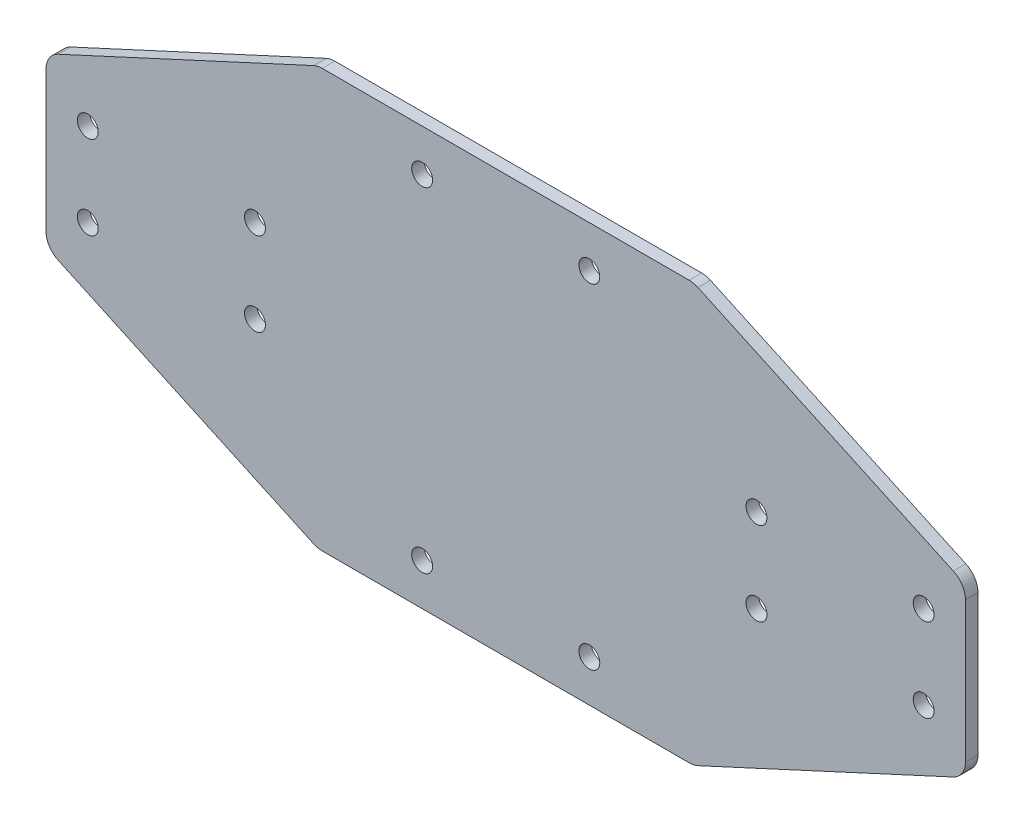
ISO-10303-21;
HEADER;
FILE_DESCRIPTION(('STEP AP214'),'2;1');
FILE_NAME('part.step','',(''),(''),'','','');
FILE_SCHEMA(('AUTOMOTIVE_DESIGN { 1 0 10303 214 1 1 1 1 }'));
ENDSEC;
DATA;
#1=APPLICATION_CONTEXT('core data for automotive mechanical design processes');
#2=APPLICATION_PROTOCOL_DEFINITION('international standard','automotive_design',2000,#1);
#3=PRODUCT_CONTEXT('',#1,'mechanical');
#4=PRODUCT('Part','Part','',(#3));
#5=PRODUCT_RELATED_PRODUCT_CATEGORY('part','',(#4));
#6=PRODUCT_DEFINITION_FORMATION('','',#4);
#7=PRODUCT_DEFINITION_CONTEXT('part definition',#1,'design');
#8=PRODUCT_DEFINITION('design','',#6,#7);
#9=PRODUCT_DEFINITION_SHAPE('','',#8);
#10=(LENGTH_UNIT() NAMED_UNIT(*) SI_UNIT(.MILLI.,.METRE.));
#11=(NAMED_UNIT(*) PLANE_ANGLE_UNIT() SI_UNIT($,.RADIAN.));
#12=(NAMED_UNIT(*) SI_UNIT($,.STERADIAN.) SOLID_ANGLE_UNIT());
#13=UNCERTAINTY_MEASURE_WITH_UNIT(LENGTH_MEASURE(1.E-05),#10,'distance_accuracy_value','');
#14=(GEOMETRIC_REPRESENTATION_CONTEXT(3) GLOBAL_UNCERTAINTY_ASSIGNED_CONTEXT((#13)) GLOBAL_UNIT_ASSIGNED_CONTEXT((#10,
#11,#12)) REPRESENTATION_CONTEXT('',''));
#15=CARTESIAN_POINT('',(0.,0.,0.));
#16=DIRECTION('',(0.,0.,1.));
#17=DIRECTION('',(1.,0.,0.));
#18=AXIS2_PLACEMENT_3D('',#15,#16,#17);
#19=CARTESIAN_POINT('',(0.,0.,3.));
#20=DIRECTION('',(0.,0.,1.));
#21=DIRECTION('',(1.,0.,0.));
#22=AXIS2_PLACEMENT_3D('',#19,#20,#21);
#23=PLANE('',#22);
#24=CARTESIAN_POINT('',(20.,-40.,3.));
#25=DIRECTION('',(0.,0.,-1.));
#26=DIRECTION('',(1.,0.,0.));
#27=AXIS2_PLACEMENT_3D('',#24,#25,#26);
#28=CIRCLE('',#27,2.5);
#29=CARTESIAN_POINT('',(22.5,-40.,3.));
#30=VERTEX_POINT('',#29);
#31=EDGE_CURVE('E343',#30,#30,#28,.T.);
#32=ORIENTED_EDGE('',*,*,#31,.T.);
#33=EDGE_LOOP('',(#32));
#34=FACE_BOUND('',#33,.T.);
#35=CARTESIAN_POINT('',(-20.,40.,3.));
#36=DIRECTION('',(0.,0.,1.));
#37=DIRECTION('',(1.,0.,0.));
#38=AXIS2_PLACEMENT_3D('',#35,#36,#37);
#39=CIRCLE('',#38,2.5);
#40=CARTESIAN_POINT('',(-17.5,40.,3.));
#41=VERTEX_POINT('',#40);
#42=EDGE_CURVE('E337',#41,#41,#39,.T.);
#43=ORIENTED_EDGE('',*,*,#42,.F.);
#44=EDGE_LOOP('',(#43));
#45=FACE_BOUND('',#44,.T.);
#46=CARTESIAN_POINT('',(20.,40.,3.));
#47=DIRECTION('',(0.,0.,1.));
#48=DIRECTION('',(1.,0.,0.));
#49=AXIS2_PLACEMENT_3D('',#46,#47,#48);
#50=CIRCLE('',#49,2.5);
#51=CARTESIAN_POINT('',(22.5,40.,3.));
#52=VERTEX_POINT('',#51);
#53=EDGE_CURVE('E331',#52,#52,#50,.T.);
#54=ORIENTED_EDGE('',*,*,#53,.F.);
#55=EDGE_LOOP('',(#54));
#56=FACE_BOUND('',#55,.T.);
#57=CARTESIAN_POINT('',(-100.,10.,3.));
#58=DIRECTION('',(0.,0.,-1.));
#59=DIRECTION('',(-1.,0.,0.));
#60=AXIS2_PLACEMENT_3D('',#57,#58,#59);
#61=CIRCLE('',#60,2.5);
#62=CARTESIAN_POINT('',(-102.5,10.,3.));
#63=VERTEX_POINT('',#62);
#64=EDGE_CURVE('E319',#63,#63,#61,.T.);
#65=ORIENTED_EDGE('',*,*,#64,.T.);
#66=EDGE_LOOP('',(#65));
#67=FACE_BOUND('',#66,.T.);
#68=CARTESIAN_POINT('',(-60.,10.,3.));
#69=DIRECTION('',(0.,0.,-1.));
#70=DIRECTION('',(-1.,0.,0.));
#71=AXIS2_PLACEMENT_3D('',#68,#69,#70);
#72=CIRCLE('',#71,2.5);
#73=CARTESIAN_POINT('',(-62.5,10.,3.));
#74=VERTEX_POINT('',#73);
#75=EDGE_CURVE('E307',#74,#74,#72,.T.);
#76=ORIENTED_EDGE('',*,*,#75,.T.);
#77=EDGE_LOOP('',(#76));
#78=FACE_BOUND('',#77,.T.);
#79=CARTESIAN_POINT('',(100.,10.,3.));
#80=DIRECTION('',(0.,0.,1.));
#81=DIRECTION('',(1.,0.,0.));
#82=AXIS2_PLACEMENT_3D('',#79,#80,#81);
#83=CIRCLE('',#82,2.5);
#84=CARTESIAN_POINT('',(102.5,10.,3.));
#85=VERTEX_POINT('',#84);
#86=EDGE_CURVE('E298',#85,#85,#83,.T.);
#87=ORIENTED_EDGE('',*,*,#86,.F.);
#88=EDGE_LOOP('',(#87));
#89=FACE_BOUND('',#88,.T.);
#90=CARTESIAN_POINT('',(60.,10.,3.));
#91=DIRECTION('',(0.,0.,1.));
#92=DIRECTION('',(1.,0.,0.));
#93=AXIS2_PLACEMENT_3D('',#90,#91,#92);
#94=CIRCLE('',#93,2.5);
#95=CARTESIAN_POINT('',(62.5,10.,3.));
#96=VERTEX_POINT('',#95);
#97=EDGE_CURVE('E295',#96,#96,#94,.T.);
#98=ORIENTED_EDGE('',*,*,#97,.F.);
#99=EDGE_LOOP('',(#98));
#100=FACE_BOUND('',#99,.T.);
#101=DIRECTION('',(0.907959384500452,-0.419058177461747,0.));
#102=VECTOR('',#101,1.);
#103=CARTESIAN_POINT('',(-110.,-20.,3.));
#104=LINE('',#103,#102);
#105=CARTESIAN_POINT('',(-107.095290887309,-21.3406349750883,3.));
#106=VERTEX_POINT('',#105);
#107=CARTESIAN_POINT('',(-45.9971066679118,-49.5397969225023,3.));
#108=VERTEX_POINT('',#107);
#109=EDGE_CURVE('E289',#106,#108,#104,.T.);
#110=ORIENTED_EDGE('',*,*,#109,.T.);
#111=CARTESIAN_POINT('',(-43.901815780603,-45.,3.));
#112=DIRECTION('',(0.,0.,1.));
#113=DIRECTION('',(1.,0.,0.));
#114=AXIS2_PLACEMENT_3D('',#111,#112,#113);
#115=CIRCLE('',#114,5.);
#116=CARTESIAN_POINT('',(-43.901815780603,-50.,3.));
#117=VERTEX_POINT('',#116);
#118=EDGE_CURVE('E236',#108,#117,#115,.T.);
#119=ORIENTED_EDGE('',*,*,#118,.T.);
#120=DIRECTION('',(1.,0.,0.));
#121=VECTOR('',#120,1.);
#122=CARTESIAN_POINT('',(-45.,-50.,3.));
#123=LINE('',#122,#121);
#124=CARTESIAN_POINT('',(43.901815780603,-50.,3.));
#125=VERTEX_POINT('',#124);
#126=EDGE_CURVE('E169',#117,#125,#123,.T.);
#127=ORIENTED_EDGE('',*,*,#126,.T.);
#128=CARTESIAN_POINT('',(43.901815780603,-45.,3.));
#129=DIRECTION('',(0.,0.,1.));
#130=DIRECTION('',(1.,0.,0.));
#131=AXIS2_PLACEMENT_3D('',#128,#129,#130);
#132=CIRCLE('',#131,5.);
#133=CARTESIAN_POINT('',(45.9971066679118,-49.5397969225023,3.));
#134=VERTEX_POINT('',#133);
#135=EDGE_CURVE('E234',#125,#134,#132,.T.);
#136=ORIENTED_EDGE('',*,*,#135,.T.);
#137=DIRECTION('',(0.907959384500452,0.419058177461747,0.));
#138=VECTOR('',#137,1.);
#139=CARTESIAN_POINT('',(45.,-50.,3.));
#140=LINE('',#139,#138);
#141=CARTESIAN_POINT('',(107.095290887309,-21.3406349750883,3.));
#142=VERTEX_POINT('',#141);
#143=EDGE_CURVE('E285',#134,#142,#140,.T.);
#144=ORIENTED_EDGE('',*,*,#143,.T.);
#145=CARTESIAN_POINT('',(105.,-16.800838052586,3.));
#146=DIRECTION('',(0.,0.,1.));
#147=DIRECTION('',(1.,0.,0.));
#148=AXIS2_PLACEMENT_3D('',#145,#146,#147);
#149=CIRCLE('',#148,5.);
#150=CARTESIAN_POINT('',(110.,-16.800838052586,3.));
#151=VERTEX_POINT('',#150);
#152=EDGE_CURVE('E232',#142,#151,#149,.T.);
#153=ORIENTED_EDGE('',*,*,#152,.T.);
#154=DIRECTION('',(0.,1.,0.));
#155=VECTOR('',#154,1.);
#156=CARTESIAN_POINT('',(110.,-20.,3.));
#157=LINE('',#156,#155);
#158=CARTESIAN_POINT('',(110.,16.800838052586,3.));
#159=VERTEX_POINT('',#158);
#160=EDGE_CURVE('E282',#151,#159,#157,.T.);
#161=ORIENTED_EDGE('',*,*,#160,.T.);
#162=CARTESIAN_POINT('',(105.,16.800838052586,3.));
#163=DIRECTION('',(0.,0.,1.));
#164=DIRECTION('',(1.,0.,0.));
#165=AXIS2_PLACEMENT_3D('',#162,#163,#164);
#166=CIRCLE('',#165,5.);
#167=CARTESIAN_POINT('',(107.095290887309,21.3406349750883,3.));
#168=VERTEX_POINT('',#167);
#169=EDGE_CURVE('E230',#159,#168,#166,.T.);
#170=ORIENTED_EDGE('',*,*,#169,.T.);
#171=DIRECTION('',(-0.907959384500452,0.419058177461747,0.));
#172=VECTOR('',#171,1.);
#173=CARTESIAN_POINT('',(110.,20.,3.));
#174=LINE('',#173,#172);
#175=CARTESIAN_POINT('',(45.9971066679118,49.5397969225023,3.));
#176=VERTEX_POINT('',#175);
#177=EDGE_CURVE('E280',#168,#176,#174,.T.);
#178=ORIENTED_EDGE('',*,*,#177,.T.);
#179=CARTESIAN_POINT('',(43.901815780603,45.,3.));
#180=DIRECTION('',(0.,0.,1.));
#181=DIRECTION('',(1.,0.,0.));
#182=AXIS2_PLACEMENT_3D('',#179,#180,#181);
#183=CIRCLE('',#182,5.);
#184=CARTESIAN_POINT('',(43.901815780603,50.,3.));
#185=VERTEX_POINT('',#184);
#186=EDGE_CURVE('E57',#176,#185,#183,.T.);
#187=ORIENTED_EDGE('',*,*,#186,.T.);
#188=DIRECTION('',(-1.,0.,0.));
#189=VECTOR('',#188,1.);
#190=CARTESIAN_POINT('',(45.,50.,3.));
#191=LINE('',#190,#189);
#192=CARTESIAN_POINT('',(-43.901815780603,50.,3.));
#193=VERTEX_POINT('',#192);
#194=EDGE_CURVE('E198',#185,#193,#191,.T.);
#195=ORIENTED_EDGE('',*,*,#194,.T.);
#196=CARTESIAN_POINT('',(-43.901815780603,45.,3.));
#197=DIRECTION('',(0.,0.,1.));
#198=DIRECTION('',(1.,0.,0.));
#199=AXIS2_PLACEMENT_3D('',#196,#197,#198);
#200=CIRCLE('',#199,5.);
#201=CARTESIAN_POINT('',(-45.9971066679118,49.5397969225023,3.));
#202=VERTEX_POINT('',#201);
#203=EDGE_CURVE('E227',#193,#202,#200,.T.);
#204=ORIENTED_EDGE('',*,*,#203,.T.);
#205=DIRECTION('',(-0.907959384500452,-0.419058177461747,0.));
#206=VECTOR('',#205,1.);
#207=CARTESIAN_POINT('',(-45.,50.,3.));
#208=LINE('',#207,#206);
#209=CARTESIAN_POINT('',(-107.095290887309,21.3406349750883,3.));
#210=VERTEX_POINT('',#209);
#211=EDGE_CURVE('E193',#202,#210,#208,.T.);
#212=ORIENTED_EDGE('',*,*,#211,.T.);
#213=CARTESIAN_POINT('',(-105.,16.800838052586,3.));
#214=DIRECTION('',(0.,0.,1.));
#215=DIRECTION('',(1.,0.,0.));
#216=AXIS2_PLACEMENT_3D('',#213,#214,#215);
#217=CIRCLE('',#216,5.);
#218=CARTESIAN_POINT('',(-110.,16.800838052586,3.));
#219=VERTEX_POINT('',#218);
#220=EDGE_CURVE('E223',#210,#219,#217,.T.);
#221=ORIENTED_EDGE('',*,*,#220,.T.);
#222=DIRECTION('',(0.,-1.,0.));
#223=VECTOR('',#222,1.);
#224=CARTESIAN_POINT('',(-110.,20.,3.));
#225=LINE('',#224,#223);
#226=CARTESIAN_POINT('',(-110.,-16.800838052586,3.));
#227=VERTEX_POINT('',#226);
#228=EDGE_CURVE('E270',#219,#227,#225,.T.);
#229=ORIENTED_EDGE('',*,*,#228,.T.);
#230=CARTESIAN_POINT('',(-105.,-16.800838052586,3.));
#231=DIRECTION('',(0.,0.,1.));
#232=DIRECTION('',(1.,0.,0.));
#233=AXIS2_PLACEMENT_3D('',#230,#231,#232);
#234=CIRCLE('',#233,5.);
#235=EDGE_CURVE('E225',#227,#106,#234,.T.);
#236=ORIENTED_EDGE('',*,*,#235,.T.);
#237=EDGE_LOOP('',(#110,#119,#127,#136,#144,#153,#161,#170,#178,#187,#195,#204,#212,#221,#229,#236));
#238=FACE_BOUND('',#237,.T.);
#239=CARTESIAN_POINT('',(60.,-10.,3.));
#240=DIRECTION('',(0.,0.,1.));
#241=DIRECTION('',(1.,0.,0.));
#242=AXIS2_PLACEMENT_3D('',#239,#240,#241);
#243=CIRCLE('',#242,2.5);
#244=CARTESIAN_POINT('',(62.5,-10.,3.));
#245=VERTEX_POINT('',#244);
#246=EDGE_CURVE('E197',#245,#245,#243,.T.);
#247=ORIENTED_EDGE('',*,*,#246,.F.);
#248=EDGE_LOOP('',(#247));
#249=FACE_BOUND('',#248,.T.);
#250=CARTESIAN_POINT('',(100.,-10.,3.));
#251=DIRECTION('',(0.,0.,1.));
#252=DIRECTION('',(1.,0.,0.));
#253=AXIS2_PLACEMENT_3D('',#250,#251,#252);
#254=CIRCLE('',#253,2.5);
#255=CARTESIAN_POINT('',(102.5,-10.,3.));
#256=VERTEX_POINT('',#255);
#257=EDGE_CURVE('E204',#256,#256,#254,.T.);
#258=ORIENTED_EDGE('',*,*,#257,.F.);
#259=EDGE_LOOP('',(#258));
#260=FACE_BOUND('',#259,.T.);
#261=CARTESIAN_POINT('',(-60.,-10.,3.));
#262=DIRECTION('',(0.,0.,-1.));
#263=DIRECTION('',(-1.,0.,0.));
#264=AXIS2_PLACEMENT_3D('',#261,#262,#263);
#265=CIRCLE('',#264,2.5);
#266=CARTESIAN_POINT('',(-62.5,-10.,3.));
#267=VERTEX_POINT('',#266);
#268=EDGE_CURVE('E313',#267,#267,#265,.T.);
#269=ORIENTED_EDGE('',*,*,#268,.T.);
#270=EDGE_LOOP('',(#269));
#271=FACE_BOUND('',#270,.T.);
#272=CARTESIAN_POINT('',(-100.,-10.,3.));
#273=DIRECTION('',(0.,0.,-1.));
#274=DIRECTION('',(-1.,0.,0.));
#275=AXIS2_PLACEMENT_3D('',#272,#273,#274);
#276=CIRCLE('',#275,2.5);
#277=CARTESIAN_POINT('',(-102.5,-10.,3.));
#278=VERTEX_POINT('',#277);
#279=EDGE_CURVE('E325',#278,#278,#276,.T.);
#280=ORIENTED_EDGE('',*,*,#279,.T.);
#281=EDGE_LOOP('',(#280));
#282=FACE_BOUND('',#281,.T.);
#283=CARTESIAN_POINT('',(-20.,-40.,3.));
#284=DIRECTION('',(0.,0.,-1.));
#285=DIRECTION('',(1.,0.,0.));
#286=AXIS2_PLACEMENT_3D('',#283,#284,#285);
#287=CIRCLE('',#286,2.5);
#288=CARTESIAN_POINT('',(-17.5,-40.,3.));
#289=VERTEX_POINT('',#288);
#290=EDGE_CURVE('E349',#289,#289,#287,.T.);
#291=ORIENTED_EDGE('',*,*,#290,.T.);
#292=EDGE_LOOP('',(#291));
#293=FACE_BOUND('',#292,.T.);
#294=ADVANCED_FACE('F35',(#34,#45,#56,#67,#78,#89,#100,#238,#249,#260,#271,#282,#293),#23,.T.);
#295=CARTESIAN_POINT('',(0.,0.,0.));
#296=DIRECTION('',(0.,0.,1.));
#297=DIRECTION('',(1.,0.,0.));
#298=AXIS2_PLACEMENT_3D('',#295,#296,#297);
#299=PLANE('',#298);
#300=CARTESIAN_POINT('',(20.,-40.,0.));
#301=DIRECTION('',(0.,0.,-1.));
#302=DIRECTION('',(1.,0.,0.));
#303=AXIS2_PLACEMENT_3D('',#300,#301,#302);
#304=CIRCLE('',#303,2.5);
#305=CARTESIAN_POINT('',(22.5,-40.,0.));
#306=VERTEX_POINT('',#305);
#307=EDGE_CURVE('E340',#306,#306,#304,.T.);
#308=ORIENTED_EDGE('',*,*,#307,.F.);
#309=EDGE_LOOP('',(#308));
#310=FACE_BOUND('',#309,.T.);
#311=CARTESIAN_POINT('',(-20.,40.,0.));
#312=DIRECTION('',(0.,0.,1.));
#313=DIRECTION('',(1.,0.,0.));
#314=AXIS2_PLACEMENT_3D('',#311,#312,#313);
#315=CIRCLE('',#314,2.5);
#316=CARTESIAN_POINT('',(-17.5,40.,0.));
#317=VERTEX_POINT('',#316);
#318=EDGE_CURVE('E334',#317,#317,#315,.T.);
#319=ORIENTED_EDGE('',*,*,#318,.T.);
#320=EDGE_LOOP('',(#319));
#321=FACE_BOUND('',#320,.T.);
#322=CARTESIAN_POINT('',(20.,40.,0.));
#323=DIRECTION('',(0.,0.,1.));
#324=DIRECTION('',(1.,0.,0.));
#325=AXIS2_PLACEMENT_3D('',#322,#323,#324);
#326=CIRCLE('',#325,2.5);
#327=CARTESIAN_POINT('',(22.5,40.,0.));
#328=VERTEX_POINT('',#327);
#329=EDGE_CURVE('E328',#328,#328,#326,.T.);
#330=ORIENTED_EDGE('',*,*,#329,.T.);
#331=EDGE_LOOP('',(#330));
#332=FACE_BOUND('',#331,.T.);
#333=CARTESIAN_POINT('',(-100.,10.,0.));
#334=DIRECTION('',(0.,0.,-1.));
#335=DIRECTION('',(-1.,0.,0.));
#336=AXIS2_PLACEMENT_3D('',#333,#334,#335);
#337=CIRCLE('',#336,2.5);
#338=CARTESIAN_POINT('',(-102.5,10.,0.));
#339=VERTEX_POINT('',#338);
#340=EDGE_CURVE('E316',#339,#339,#337,.T.);
#341=ORIENTED_EDGE('',*,*,#340,.F.);
#342=EDGE_LOOP('',(#341));
#343=FACE_BOUND('',#342,.T.);
#344=CARTESIAN_POINT('',(-60.,10.,0.));
#345=DIRECTION('',(0.,0.,-1.));
#346=DIRECTION('',(-1.,0.,0.));
#347=AXIS2_PLACEMENT_3D('',#344,#345,#346);
#348=CIRCLE('',#347,2.5);
#349=CARTESIAN_POINT('',(-62.5,10.,0.));
#350=VERTEX_POINT('',#349);
#351=EDGE_CURVE('E306',#350,#350,#348,.T.);
#352=ORIENTED_EDGE('',*,*,#351,.F.);
#353=EDGE_LOOP('',(#352));
#354=FACE_BOUND('',#353,.T.);
#355=CARTESIAN_POINT('',(100.,10.,0.));
#356=DIRECTION('',(0.,0.,1.));
#357=DIRECTION('',(1.,0.,0.));
#358=AXIS2_PLACEMENT_3D('',#355,#356,#357);
#359=CIRCLE('',#358,2.5);
#360=CARTESIAN_POINT('',(102.5,10.,0.));
#361=VERTEX_POINT('',#360);
#362=EDGE_CURVE('E303',#361,#361,#359,.T.);
#363=ORIENTED_EDGE('',*,*,#362,.T.);
#364=EDGE_LOOP('',(#363));
#365=FACE_BOUND('',#364,.T.);
#366=CARTESIAN_POINT('',(60.,10.,0.));
#367=DIRECTION('',(0.,0.,1.));
#368=DIRECTION('',(1.,0.,0.));
#369=AXIS2_PLACEMENT_3D('',#366,#367,#368);
#370=CIRCLE('',#369,2.5);
#371=CARTESIAN_POINT('',(62.5,10.,0.));
#372=VERTEX_POINT('',#371);
#373=EDGE_CURVE('E276',#372,#372,#370,.T.);
#374=ORIENTED_EDGE('',*,*,#373,.T.);
#375=EDGE_LOOP('',(#374));
#376=FACE_BOUND('',#375,.T.);
#377=DIRECTION('',(1.,0.,0.));
#378=VECTOR('',#377,1.);
#379=CARTESIAN_POINT('',(-45.,-50.,0.));
#380=LINE('',#379,#378);
#381=CARTESIAN_POINT('',(-43.901815780603,-50.,0.));
#382=VERTEX_POINT('',#381);
#383=CARTESIAN_POINT('',(43.901815780603,-50.,0.));
#384=VERTEX_POINT('',#383);
#385=EDGE_CURVE('E166',#382,#384,#380,.T.);
#386=ORIENTED_EDGE('',*,*,#385,.F.);
#387=CARTESIAN_POINT('',(-43.901815780603,-45.,0.));
#388=DIRECTION('',(0.,0.,1.));
#389=DIRECTION('',(1.,0.,0.));
#390=AXIS2_PLACEMENT_3D('',#387,#388,#389);
#391=CIRCLE('',#390,5.);
#392=CARTESIAN_POINT('',(-45.9971066679118,-49.5397969225023,0.));
#393=VERTEX_POINT('',#392);
#394=EDGE_CURVE('E149',#382,#393,#391,.F.);
#395=ORIENTED_EDGE('',*,*,#394,.T.);
#396=DIRECTION('',(0.907959384500452,-0.419058177461747,0.));
#397=VECTOR('',#396,1.);
#398=CARTESIAN_POINT('',(-110.,-20.,0.));
#399=LINE('',#398,#397);
#400=CARTESIAN_POINT('',(-107.095290887309,-21.3406349750883,0.));
#401=VERTEX_POINT('',#400);
#402=EDGE_CURVE('E177',#401,#393,#399,.T.);
#403=ORIENTED_EDGE('',*,*,#402,.F.);
#404=CARTESIAN_POINT('',(-105.,-16.800838052586,0.));
#405=DIRECTION('',(0.,0.,1.));
#406=DIRECTION('',(1.,0.,0.));
#407=AXIS2_PLACEMENT_3D('',#404,#405,#406);
#408=CIRCLE('',#407,5.);
#409=CARTESIAN_POINT('',(-110.,-16.800838052586,0.));
#410=VERTEX_POINT('',#409);
#411=EDGE_CURVE('E209',#401,#410,#408,.F.);
#412=ORIENTED_EDGE('',*,*,#411,.T.);
#413=DIRECTION('',(0.,-1.,0.));
#414=VECTOR('',#413,1.);
#415=CARTESIAN_POINT('',(-110.,20.,0.));
#416=LINE('',#415,#414);
#417=CARTESIAN_POINT('',(-110.,16.800838052586,0.));
#418=VERTEX_POINT('',#417);
#419=EDGE_CURVE('E182',#418,#410,#416,.T.);
#420=ORIENTED_EDGE('',*,*,#419,.F.);
#421=CARTESIAN_POINT('',(-105.,16.800838052586,0.));
#422=DIRECTION('',(0.,0.,1.));
#423=DIRECTION('',(1.,0.,0.));
#424=AXIS2_PLACEMENT_3D('',#421,#422,#423);
#425=CIRCLE('',#424,5.);
#426=CARTESIAN_POINT('',(-107.095290887309,21.3406349750883,0.));
#427=VERTEX_POINT('',#426);
#428=EDGE_CURVE('E170',#418,#427,#425,.F.);
#429=ORIENTED_EDGE('',*,*,#428,.T.);
#430=DIRECTION('',(-0.907959384500452,-0.419058177461747,0.));
#431=VECTOR('',#430,1.);
#432=CARTESIAN_POINT('',(-45.,50.,0.));
#433=LINE('',#432,#431);
#434=CARTESIAN_POINT('',(-45.9971066679118,49.5397969225023,0.));
#435=VERTEX_POINT('',#434);
#436=EDGE_CURVE('E275',#435,#427,#433,.T.);
#437=ORIENTED_EDGE('',*,*,#436,.F.);
#438=CARTESIAN_POINT('',(-43.901815780603,45.,0.));
#439=DIRECTION('',(0.,0.,1.));
#440=DIRECTION('',(1.,0.,0.));
#441=AXIS2_PLACEMENT_3D('',#438,#439,#440);
#442=CIRCLE('',#441,5.);
#443=CARTESIAN_POINT('',(-43.901815780603,50.,0.));
#444=VERTEX_POINT('',#443);
#445=EDGE_CURVE('E211',#435,#444,#442,.F.);
#446=ORIENTED_EDGE('',*,*,#445,.T.);
#447=DIRECTION('',(-1.,0.,0.));
#448=VECTOR('',#447,1.);
#449=CARTESIAN_POINT('',(45.,50.,0.));
#450=LINE('',#449,#448);
#451=CARTESIAN_POINT('',(43.901815780603,50.,0.));
#452=VERTEX_POINT('',#451);
#453=EDGE_CURVE('E191',#452,#444,#450,.T.);
#454=ORIENTED_EDGE('',*,*,#453,.F.);
#455=CARTESIAN_POINT('',(43.901815780603,45.,0.));
#456=DIRECTION('',(0.,0.,1.));
#457=DIRECTION('',(1.,0.,0.));
#458=AXIS2_PLACEMENT_3D('',#455,#456,#457);
#459=CIRCLE('',#458,5.);
#460=CARTESIAN_POINT('',(45.9971066679118,49.5397969225023,0.));
#461=VERTEX_POINT('',#460);
#462=EDGE_CURVE('E213',#452,#461,#459,.F.);
#463=ORIENTED_EDGE('',*,*,#462,.T.);
#464=DIRECTION('',(-0.907959384500452,0.419058177461747,0.));
#465=VECTOR('',#464,1.);
#466=CARTESIAN_POINT('',(110.,20.,0.));
#467=LINE('',#466,#465);
#468=CARTESIAN_POINT('',(107.095290887309,21.3406349750883,0.));
#469=VERTEX_POINT('',#468);
#470=EDGE_CURVE('E188',#469,#461,#467,.T.);
#471=ORIENTED_EDGE('',*,*,#470,.F.);
#472=CARTESIAN_POINT('',(105.,16.800838052586,0.));
#473=DIRECTION('',(0.,0.,1.));
#474=DIRECTION('',(1.,0.,0.));
#475=AXIS2_PLACEMENT_3D('',#472,#473,#474);
#476=CIRCLE('',#475,5.);
#477=CARTESIAN_POINT('',(110.,16.800838052586,0.));
#478=VERTEX_POINT('',#477);
#479=EDGE_CURVE('E215',#469,#478,#476,.F.);
#480=ORIENTED_EDGE('',*,*,#479,.T.);
#481=DIRECTION('',(0.,1.,0.));
#482=VECTOR('',#481,1.);
#483=CARTESIAN_POINT('',(110.,-20.,0.));
#484=LINE('',#483,#482);
#485=CARTESIAN_POINT('',(110.,-16.800838052586,0.));
#486=VERTEX_POINT('',#485);
#487=EDGE_CURVE('E180',#486,#478,#484,.T.);
#488=ORIENTED_EDGE('',*,*,#487,.F.);
#489=CARTESIAN_POINT('',(105.,-16.800838052586,0.));
#490=DIRECTION('',(0.,0.,1.));
#491=DIRECTION('',(1.,0.,0.));
#492=AXIS2_PLACEMENT_3D('',#489,#490,#491);
#493=CIRCLE('',#492,5.);
#494=CARTESIAN_POINT('',(107.095290887309,-21.3406349750883,0.));
#495=VERTEX_POINT('',#494);
#496=EDGE_CURVE('E217',#486,#495,#493,.F.);
#497=ORIENTED_EDGE('',*,*,#496,.T.);
#498=DIRECTION('',(0.907959384500452,0.419058177461747,0.));
#499=VECTOR('',#498,1.);
#500=CARTESIAN_POINT('',(45.,-50.,0.));
#501=LINE('',#500,#499);
#502=CARTESIAN_POINT('',(45.9971066679118,-49.5397969225023,0.));
#503=VERTEX_POINT('',#502);
#504=EDGE_CURVE('E176',#503,#495,#501,.T.);
#505=ORIENTED_EDGE('',*,*,#504,.F.);
#506=CARTESIAN_POINT('',(43.901815780603,-45.,0.));
#507=DIRECTION('',(0.,0.,1.));
#508=DIRECTION('',(1.,0.,0.));
#509=AXIS2_PLACEMENT_3D('',#506,#507,#508);
#510=CIRCLE('',#509,5.);
#511=EDGE_CURVE('E160',#503,#384,#510,.F.);
#512=ORIENTED_EDGE('',*,*,#511,.T.);
#513=EDGE_LOOP('',(#386,#395,#403,#412,#420,#429,#437,#446,#454,#463,#471,#480,#488,#497,#505,#512));
#514=FACE_BOUND('',#513,.T.);
#515=CARTESIAN_POINT('',(60.,-10.,0.));
#516=DIRECTION('',(0.,0.,1.));
#517=DIRECTION('',(1.,0.,0.));
#518=AXIS2_PLACEMENT_3D('',#515,#516,#517);
#519=CIRCLE('',#518,2.5);
#520=CARTESIAN_POINT('',(62.5,-10.,0.));
#521=VERTEX_POINT('',#520);
#522=EDGE_CURVE('E194',#521,#521,#519,.T.);
#523=ORIENTED_EDGE('',*,*,#522,.T.);
#524=EDGE_LOOP('',(#523));
#525=FACE_BOUND('',#524,.T.);
#526=CARTESIAN_POINT('',(100.,-10.,0.));
#527=DIRECTION('',(0.,0.,1.));
#528=DIRECTION('',(1.,0.,0.));
#529=AXIS2_PLACEMENT_3D('',#526,#527,#528);
#530=CIRCLE('',#529,2.5);
#531=CARTESIAN_POINT('',(102.5,-10.,0.));
#532=VERTEX_POINT('',#531);
#533=EDGE_CURVE('E201',#532,#532,#530,.T.);
#534=ORIENTED_EDGE('',*,*,#533,.T.);
#535=EDGE_LOOP('',(#534));
#536=FACE_BOUND('',#535,.T.);
#537=CARTESIAN_POINT('',(-60.,-10.,0.));
#538=DIRECTION('',(0.,0.,-1.));
#539=DIRECTION('',(-1.,0.,0.));
#540=AXIS2_PLACEMENT_3D('',#537,#538,#539);
#541=CIRCLE('',#540,2.5);
#542=CARTESIAN_POINT('',(-62.5,-10.,0.));
#543=VERTEX_POINT('',#542);
#544=EDGE_CURVE('E310',#543,#543,#541,.T.);
#545=ORIENTED_EDGE('',*,*,#544,.F.);
#546=EDGE_LOOP('',(#545));
#547=FACE_BOUND('',#546,.T.);
#548=CARTESIAN_POINT('',(-100.,-10.,0.));
#549=DIRECTION('',(0.,0.,-1.));
#550=DIRECTION('',(-1.,0.,0.));
#551=AXIS2_PLACEMENT_3D('',#548,#549,#550);
#552=CIRCLE('',#551,2.5);
#553=CARTESIAN_POINT('',(-102.5,-10.,0.));
#554=VERTEX_POINT('',#553);
#555=EDGE_CURVE('E322',#554,#554,#552,.T.);
#556=ORIENTED_EDGE('',*,*,#555,.F.);
#557=EDGE_LOOP('',(#556));
#558=FACE_BOUND('',#557,.T.);
#559=CARTESIAN_POINT('',(-20.,-40.,0.));
#560=DIRECTION('',(0.,0.,-1.));
#561=DIRECTION('',(1.,0.,0.));
#562=AXIS2_PLACEMENT_3D('',#559,#560,#561);
#563=CIRCLE('',#562,2.5);
#564=CARTESIAN_POINT('',(-17.5,-40.,0.));
#565=VERTEX_POINT('',#564);
#566=EDGE_CURVE('E346',#565,#565,#563,.T.);
#567=ORIENTED_EDGE('',*,*,#566,.F.);
#568=EDGE_LOOP('',(#567));
#569=FACE_BOUND('',#568,.T.);
#570=ADVANCED_FACE('F173',(#310,#321,#332,#343,#354,#365,#376,#514,#525,#536,#547,#558,#569),
#299,.F.);
#571=CARTESIAN_POINT('',(-45.,50.,3.));
#572=DIRECTION('',(0.419058177461747,-0.907959384500452,0.));
#573=DIRECTION('',(0.907959384500452,0.419058177461747,0.));
#574=AXIS2_PLACEMENT_3D('',#571,#572,#573);
#575=PLANE('',#574);
#576=ORIENTED_EDGE('',*,*,#211,.F.);
#577=DIRECTION('',(0.,0.,-1.));
#578=VECTOR('',#577,1.);
#579=CARTESIAN_POINT('',(-45.9971066679118,49.5397969225023,3.));
#580=LINE('',#579,#578);
#581=EDGE_CURVE('E259',#202,#435,#580,.T.);
#582=ORIENTED_EDGE('',*,*,#581,.T.);
#583=ORIENTED_EDGE('',*,*,#436,.T.);
#584=DIRECTION('',(0.,0.,-1.));
#585=VECTOR('',#584,1.);
#586=CARTESIAN_POINT('',(-107.095290887309,21.3406349750883,3.));
#587=LINE('',#586,#585);
#588=EDGE_CURVE('E257',#427,#210,#587,.F.);
#589=ORIENTED_EDGE('',*,*,#588,.T.);
#590=EDGE_LOOP('',(#576,#582,#583,#589));
#591=FACE_BOUND('',#590,.T.);
#592=ADVANCED_FACE('F359',(#591),#575,.F.);
#593=CARTESIAN_POINT('',(-110.,20.,3.));
#594=DIRECTION('',(1.,0.,0.));
#595=DIRECTION('',(0.,0.,-1.));
#596=AXIS2_PLACEMENT_3D('',#593,#594,#595);
#597=PLANE('',#596);
#598=ORIENTED_EDGE('',*,*,#419,.T.);
#599=DIRECTION('',(0.,0.,-1.));
#600=VECTOR('',#599,1.);
#601=CARTESIAN_POINT('',(-110.,-16.800838052586,3.));
#602=LINE('',#601,#600);
#603=EDGE_CURVE('E11',#410,#227,#602,.F.);
#604=ORIENTED_EDGE('',*,*,#603,.T.);
#605=ORIENTED_EDGE('',*,*,#228,.F.);
#606=DIRECTION('',(0.,0.,-1.));
#607=VECTOR('',#606,1.);
#608=CARTESIAN_POINT('',(-110.,16.800838052586,3.));
#609=LINE('',#608,#607);
#610=EDGE_CURVE('E43',#219,#418,#609,.T.);
#611=ORIENTED_EDGE('',*,*,#610,.T.);
#612=EDGE_LOOP('',(#598,#604,#605,#611));
#613=FACE_BOUND('',#612,.T.);
#614=ADVANCED_FACE('F267',(#613),#597,.F.);
#615=CARTESIAN_POINT('',(-110.,-20.,3.));
#616=DIRECTION('',(0.419058177461747,0.907959384500452,0.));
#617=DIRECTION('',(-0.907959384500452,0.419058177461747,0.));
#618=AXIS2_PLACEMENT_3D('',#615,#616,#617);
#619=PLANE('',#618);
#620=ORIENTED_EDGE('',*,*,#402,.T.);
#621=DIRECTION('',(0.,0.,-1.));
#622=VECTOR('',#621,1.);
#623=CARTESIAN_POINT('',(-45.9971066679118,-49.5397969225023,3.));
#624=LINE('',#623,#622);
#625=EDGE_CURVE('E154',#393,#108,#624,.F.);
#626=ORIENTED_EDGE('',*,*,#625,.T.);
#627=ORIENTED_EDGE('',*,*,#109,.F.);
#628=DIRECTION('',(0.,0.,-1.));
#629=VECTOR('',#628,1.);
#630=CARTESIAN_POINT('',(-107.095290887309,-21.3406349750883,3.));
#631=LINE('',#630,#629);
#632=EDGE_CURVE('E159',#106,#401,#631,.T.);
#633=ORIENTED_EDGE('',*,*,#632,.T.);
#634=EDGE_LOOP('',(#620,#626,#627,#633));
#635=FACE_BOUND('',#634,.T.);
#636=ADVANCED_FACE('F392',(#635),#619,.F.);
#637=CARTESIAN_POINT('',(-45.,-50.,3.));
#638=DIRECTION('',(0.,1.,0.));
#639=DIRECTION('',(0.,0.,1.));
#640=AXIS2_PLACEMENT_3D('',#637,#638,#639);
#641=PLANE('',#640);
#642=ORIENTED_EDGE('',*,*,#126,.F.);
#643=DIRECTION('',(0.,0.,-1.));
#644=VECTOR('',#643,1.);
#645=CARTESIAN_POINT('',(-43.901815780603,-50.,3.));
#646=LINE('',#645,#644);
#647=EDGE_CURVE('E153',#117,#382,#646,.T.);
#648=ORIENTED_EDGE('',*,*,#647,.T.);
#649=ORIENTED_EDGE('',*,*,#385,.T.);
#650=DIRECTION('',(0.,0.,-1.));
#651=VECTOR('',#650,1.);
#652=CARTESIAN_POINT('',(43.901815780603,-50.,3.));
#653=LINE('',#652,#651);
#654=EDGE_CURVE('E171',#384,#125,#653,.F.);
#655=ORIENTED_EDGE('',*,*,#654,.T.);
#656=EDGE_LOOP('',(#642,#648,#649,#655));
#657=FACE_BOUND('',#656,.T.);
#658=ADVANCED_FACE('F165',(#657),#641,.F.);
#659=CARTESIAN_POINT('',(45.,-50.,3.));
#660=DIRECTION('',(-0.419058177461747,0.907959384500452,0.));
#661=DIRECTION('',(-0.907959384500452,-0.419058177461747,0.));
#662=AXIS2_PLACEMENT_3D('',#659,#660,#661);
#663=PLANE('',#662);
#664=ORIENTED_EDGE('',*,*,#143,.F.);
#665=DIRECTION('',(0.,0.,-1.));
#666=VECTOR('',#665,1.);
#667=CARTESIAN_POINT('',(45.9971066679118,-49.5397969225023,3.));
#668=LINE('',#667,#666);
#669=EDGE_CURVE('E240',#134,#503,#668,.T.);
#670=ORIENTED_EDGE('',*,*,#669,.T.);
#671=ORIENTED_EDGE('',*,*,#504,.T.);
#672=DIRECTION('',(0.,0.,-1.));
#673=VECTOR('',#672,1.);
#674=CARTESIAN_POINT('',(107.095290887309,-21.3406349750883,3.));
#675=LINE('',#674,#673);
#676=EDGE_CURVE('E238',#495,#142,#675,.F.);
#677=ORIENTED_EDGE('',*,*,#676,.T.);
#678=EDGE_LOOP('',(#664,#670,#671,#677));
#679=FACE_BOUND('',#678,.T.);
#680=ADVANCED_FACE('F385',(#679),#663,.F.);
#681=CARTESIAN_POINT('',(110.,-20.,3.));
#682=DIRECTION('',(-1.,0.,0.));
#683=DIRECTION('',(0.,0.,1.));
#684=AXIS2_PLACEMENT_3D('',#681,#682,#683);
#685=PLANE('',#684);
#686=ORIENTED_EDGE('',*,*,#160,.F.);
#687=DIRECTION('',(0.,0.,-1.));
#688=VECTOR('',#687,1.);
#689=CARTESIAN_POINT('',(110.,-16.800838052586,3.));
#690=LINE('',#689,#688);
#691=EDGE_CURVE('E245',#151,#486,#690,.T.);
#692=ORIENTED_EDGE('',*,*,#691,.T.);
#693=ORIENTED_EDGE('',*,*,#487,.T.);
#694=DIRECTION('',(0.,0.,-1.));
#695=VECTOR('',#694,1.);
#696=CARTESIAN_POINT('',(110.,16.800838052586,3.));
#697=LINE('',#696,#695);
#698=EDGE_CURVE('E243',#478,#159,#697,.F.);
#699=ORIENTED_EDGE('',*,*,#698,.T.);
#700=EDGE_LOOP('',(#686,#692,#693,#699));
#701=FACE_BOUND('',#700,.T.);
#702=ADVANCED_FACE('F381',(#701),#685,.F.);
#703=CARTESIAN_POINT('',(110.,20.,3.));
#704=DIRECTION('',(-0.419058177461747,-0.907959384500452,0.));
#705=DIRECTION('',(0.907959384500452,-0.419058177461747,0.));
#706=AXIS2_PLACEMENT_3D('',#703,#704,#705);
#707=PLANE('',#706);
#708=ORIENTED_EDGE('',*,*,#177,.F.);
#709=DIRECTION('',(0.,0.,-1.));
#710=VECTOR('',#709,1.);
#711=CARTESIAN_POINT('',(107.095290887309,21.3406349750883,3.));
#712=LINE('',#711,#710);
#713=EDGE_CURVE('E250',#168,#469,#712,.T.);
#714=ORIENTED_EDGE('',*,*,#713,.T.);
#715=ORIENTED_EDGE('',*,*,#470,.T.);
#716=DIRECTION('',(0.,0.,-1.));
#717=VECTOR('',#716,1.);
#718=CARTESIAN_POINT('',(45.9971066679118,49.5397969225023,3.));
#719=LINE('',#718,#717);
#720=EDGE_CURVE('E248',#461,#176,#719,.F.);
#721=ORIENTED_EDGE('',*,*,#720,.T.);
#722=EDGE_LOOP('',(#708,#714,#715,#721));
#723=FACE_BOUND('',#722,.T.);
#724=ADVANCED_FACE('F378',(#723),#707,.F.);
#725=CARTESIAN_POINT('',(45.,50.,3.));
#726=DIRECTION('',(0.,-1.,0.));
#727=DIRECTION('',(0.,0.,-1.));
#728=AXIS2_PLACEMENT_3D('',#725,#726,#727);
#729=PLANE('',#728);
#730=ORIENTED_EDGE('',*,*,#194,.F.);
#731=DIRECTION('',(0.,0.,-1.));
#732=VECTOR('',#731,1.);
#733=CARTESIAN_POINT('',(43.901815780603,50.,3.));
#734=LINE('',#733,#732);
#735=EDGE_CURVE('E254',#185,#452,#734,.T.);
#736=ORIENTED_EDGE('',*,*,#735,.T.);
#737=ORIENTED_EDGE('',*,*,#453,.T.);
#738=DIRECTION('',(0.,0.,-1.));
#739=VECTOR('',#738,1.);
#740=CARTESIAN_POINT('',(-43.901815780603,50.,3.));
#741=LINE('',#740,#739);
#742=EDGE_CURVE('E50',#444,#193,#741,.F.);
#743=ORIENTED_EDGE('',*,*,#742,.T.);
#744=EDGE_LOOP('',(#730,#736,#737,#743));
#745=FACE_BOUND('',#744,.T.);
#746=ADVANCED_FACE('F374',(#745),#729,.F.);
#747=CARTESIAN_POINT('',(60.,10.,0.));
#748=DIRECTION('',(0.,0.,1.));
#749=DIRECTION('',(1.,0.,0.));
#750=AXIS2_PLACEMENT_3D('',#747,#748,#749);
#751=CYLINDRICAL_SURFACE('',#750,2.5);
#752=ORIENTED_EDGE('',*,*,#373,.F.);
#753=EDGE_LOOP('',(#752));
#754=FACE_BOUND('',#753,.T.);
#755=ORIENTED_EDGE('',*,*,#97,.T.);
#756=EDGE_LOOP('',(#755));
#757=FACE_BOUND('',#756,.T.);
#758=ADVANCED_FACE('F377',(#754,#757),#751,.F.);
#759=CARTESIAN_POINT('',(100.,10.,0.));
#760=DIRECTION('',(0.,0.,1.));
#761=DIRECTION('',(1.,0.,0.));
#762=AXIS2_PLACEMENT_3D('',#759,#760,#761);
#763=CYLINDRICAL_SURFACE('',#762,2.5);
#764=ORIENTED_EDGE('',*,*,#362,.F.);
#765=EDGE_LOOP('',(#764));
#766=FACE_BOUND('',#765,.T.);
#767=ORIENTED_EDGE('',*,*,#86,.T.);
#768=EDGE_LOOP('',(#767));
#769=FACE_BOUND('',#768,.T.);
#770=ADVANCED_FACE('F402',(#766,#769),#763,.F.);
#771=CARTESIAN_POINT('',(60.,-10.,0.));
#772=DIRECTION('',(0.,0.,1.));
#773=DIRECTION('',(1.,0.,0.));
#774=AXIS2_PLACEMENT_3D('',#771,#772,#773);
#775=CYLINDRICAL_SURFACE('',#774,2.5);
#776=ORIENTED_EDGE('',*,*,#522,.F.);
#777=EDGE_LOOP('',(#776));
#778=FACE_BOUND('',#777,.T.);
#779=ORIENTED_EDGE('',*,*,#246,.T.);
#780=EDGE_LOOP('',(#779));
#781=FACE_BOUND('',#780,.T.);
#782=ADVANCED_FACE('F398',(#778,#781),#775,.F.);
#783=CARTESIAN_POINT('',(100.,-10.,0.));
#784=DIRECTION('',(0.,0.,1.));
#785=DIRECTION('',(1.,0.,0.));
#786=AXIS2_PLACEMENT_3D('',#783,#784,#785);
#787=CYLINDRICAL_SURFACE('',#786,2.5);
#788=ORIENTED_EDGE('',*,*,#533,.F.);
#789=EDGE_LOOP('',(#788));
#790=FACE_BOUND('',#789,.T.);
#791=ORIENTED_EDGE('',*,*,#257,.T.);
#792=EDGE_LOOP('',(#791));
#793=FACE_BOUND('',#792,.T.);
#794=ADVANCED_FACE('F401',(#790,#793),#787,.F.);
#795=CARTESIAN_POINT('',(-60.,10.,0.));
#796=DIRECTION('',(0.,0.,1.));
#797=DIRECTION('',(1.,0.,0.));
#798=AXIS2_PLACEMENT_3D('',#795,#796,#797);
#799=CYLINDRICAL_SURFACE('',#798,2.5);
#800=ORIENTED_EDGE('',*,*,#351,.T.);
#801=EDGE_LOOP('',(#800));
#802=FACE_BOUND('',#801,.T.);
#803=ORIENTED_EDGE('',*,*,#75,.F.);
#804=EDGE_LOOP('',(#803));
#805=FACE_BOUND('',#804,.T.);
#806=ADVANCED_FACE('F406',(#802,#805),#799,.F.);
#807=CARTESIAN_POINT('',(-60.,-10.,0.));
#808=DIRECTION('',(0.,0.,1.));
#809=DIRECTION('',(1.,0.,0.));
#810=AXIS2_PLACEMENT_3D('',#807,#808,#809);
#811=CYLINDRICAL_SURFACE('',#810,2.5);
#812=ORIENTED_EDGE('',*,*,#544,.T.);
#813=EDGE_LOOP('',(#812));
#814=FACE_BOUND('',#813,.T.);
#815=ORIENTED_EDGE('',*,*,#268,.F.);
#816=EDGE_LOOP('',(#815));
#817=FACE_BOUND('',#816,.T.);
#818=ADVANCED_FACE('F492',(#814,#817),#811,.F.);
#819=CARTESIAN_POINT('',(-100.,10.,0.));
#820=DIRECTION('',(0.,0.,1.));
#821=DIRECTION('',(1.,0.,0.));
#822=AXIS2_PLACEMENT_3D('',#819,#820,#821);
#823=CYLINDRICAL_SURFACE('',#822,2.5);
#824=ORIENTED_EDGE('',*,*,#340,.T.);
#825=EDGE_LOOP('',(#824));
#826=FACE_BOUND('',#825,.T.);
#827=ORIENTED_EDGE('',*,*,#64,.F.);
#828=EDGE_LOOP('',(#827));
#829=FACE_BOUND('',#828,.T.);
#830=ADVANCED_FACE('F488',(#826,#829),#823,.F.);
#831=CARTESIAN_POINT('',(-100.,-10.,0.));
#832=DIRECTION('',(0.,0.,1.));
#833=DIRECTION('',(1.,0.,0.));
#834=AXIS2_PLACEMENT_3D('',#831,#832,#833);
#835=CYLINDRICAL_SURFACE('',#834,2.5);
#836=ORIENTED_EDGE('',*,*,#555,.T.);
#837=EDGE_LOOP('',(#836));
#838=FACE_BOUND('',#837,.T.);
#839=ORIENTED_EDGE('',*,*,#279,.F.);
#840=EDGE_LOOP('',(#839));
#841=FACE_BOUND('',#840,.T.);
#842=ADVANCED_FACE('F484',(#838,#841),#835,.F.);
#843=CARTESIAN_POINT('',(20.,40.,0.));
#844=DIRECTION('',(0.,0.,1.));
#845=DIRECTION('',(1.,0.,0.));
#846=AXIS2_PLACEMENT_3D('',#843,#844,#845);
#847=CYLINDRICAL_SURFACE('',#846,2.5);
#848=ORIENTED_EDGE('',*,*,#329,.F.);
#849=EDGE_LOOP('',(#848));
#850=FACE_BOUND('',#849,.T.);
#851=ORIENTED_EDGE('',*,*,#53,.T.);
#852=EDGE_LOOP('',(#851));
#853=FACE_BOUND('',#852,.T.);
#854=ADVANCED_FACE('F480',(#850,#853),#847,.F.);
#855=CARTESIAN_POINT('',(-20.,40.,0.));
#856=DIRECTION('',(0.,0.,1.));
#857=DIRECTION('',(1.,0.,0.));
#858=AXIS2_PLACEMENT_3D('',#855,#856,#857);
#859=CYLINDRICAL_SURFACE('',#858,2.5);
#860=ORIENTED_EDGE('',*,*,#318,.F.);
#861=EDGE_LOOP('',(#860));
#862=FACE_BOUND('',#861,.T.);
#863=ORIENTED_EDGE('',*,*,#42,.T.);
#864=EDGE_LOOP('',(#863));
#865=FACE_BOUND('',#864,.T.);
#866=ADVANCED_FACE('F474',(#862,#865),#859,.F.);
#867=CARTESIAN_POINT('',(20.,-40.,0.));
#868=DIRECTION('',(0.,0.,1.));
#869=DIRECTION('',(1.,0.,0.));
#870=AXIS2_PLACEMENT_3D('',#867,#868,#869);
#871=CYLINDRICAL_SURFACE('',#870,2.5);
#872=ORIENTED_EDGE('',*,*,#307,.T.);
#873=EDGE_LOOP('',(#872));
#874=FACE_BOUND('',#873,.T.);
#875=ORIENTED_EDGE('',*,*,#31,.F.);
#876=EDGE_LOOP('',(#875));
#877=FACE_BOUND('',#876,.T.);
#878=ADVANCED_FACE('F469',(#874,#877),#871,.F.);
#879=CARTESIAN_POINT('',(-20.,-40.,0.));
#880=DIRECTION('',(0.,0.,1.));
#881=DIRECTION('',(1.,0.,0.));
#882=AXIS2_PLACEMENT_3D('',#879,#880,#881);
#883=CYLINDRICAL_SURFACE('',#882,2.5);
#884=ORIENTED_EDGE('',*,*,#566,.T.);
#885=EDGE_LOOP('',(#884));
#886=FACE_BOUND('',#885,.T.);
#887=ORIENTED_EDGE('',*,*,#290,.F.);
#888=EDGE_LOOP('',(#887));
#889=FACE_BOUND('',#888,.T.);
#890=ADVANCED_FACE('F355',(#886,#889),#883,.F.);
#891=CARTESIAN_POINT('',(-43.901815780603,-45.,3.));
#892=DIRECTION('',(0.,0.,-1.));
#893=DIRECTION('',(-1.,0.,0.));
#894=AXIS2_PLACEMENT_3D('',#891,#892,#893);
#895=CYLINDRICAL_SURFACE('',#894,5.);
#896=ORIENTED_EDGE('',*,*,#118,.F.);
#897=ORIENTED_EDGE('',*,*,#625,.F.);
#898=ORIENTED_EDGE('',*,*,#394,.F.);
#899=ORIENTED_EDGE('',*,*,#647,.F.);
#900=EDGE_LOOP('',(#896,#897,#898,#899));
#901=FACE_BOUND('',#900,.T.);
#902=ADVANCED_FACE('F152',(#901),#895,.T.);
#903=CARTESIAN_POINT('',(43.901815780603,-45.,3.));
#904=DIRECTION('',(0.,0.,-1.));
#905=DIRECTION('',(-1.,0.,0.));
#906=AXIS2_PLACEMENT_3D('',#903,#904,#905);
#907=CYLINDRICAL_SURFACE('',#906,5.);
#908=ORIENTED_EDGE('',*,*,#135,.F.);
#909=ORIENTED_EDGE('',*,*,#654,.F.);
#910=ORIENTED_EDGE('',*,*,#511,.F.);
#911=ORIENTED_EDGE('',*,*,#669,.F.);
#912=EDGE_LOOP('',(#908,#909,#910,#911));
#913=FACE_BOUND('',#912,.T.);
#914=ADVANCED_FACE('F410',(#913),#907,.T.);
#915=CARTESIAN_POINT('',(105.,-16.800838052586,3.));
#916=DIRECTION('',(0.,0.,-1.));
#917=DIRECTION('',(-1.,0.,0.));
#918=AXIS2_PLACEMENT_3D('',#915,#916,#917);
#919=CYLINDRICAL_SURFACE('',#918,5.);
#920=ORIENTED_EDGE('',*,*,#152,.F.);
#921=ORIENTED_EDGE('',*,*,#676,.F.);
#922=ORIENTED_EDGE('',*,*,#496,.F.);
#923=ORIENTED_EDGE('',*,*,#691,.F.);
#924=EDGE_LOOP('',(#920,#921,#922,#923));
#925=FACE_BOUND('',#924,.T.);
#926=ADVANCED_FACE('F413',(#925),#919,.T.);
#927=CARTESIAN_POINT('',(105.,16.800838052586,3.));
#928=DIRECTION('',(0.,0.,-1.));
#929=DIRECTION('',(-1.,0.,0.));
#930=AXIS2_PLACEMENT_3D('',#927,#928,#929);
#931=CYLINDRICAL_SURFACE('',#930,5.);
#932=ORIENTED_EDGE('',*,*,#169,.F.);
#933=ORIENTED_EDGE('',*,*,#698,.F.);
#934=ORIENTED_EDGE('',*,*,#479,.F.);
#935=ORIENTED_EDGE('',*,*,#713,.F.);
#936=EDGE_LOOP('',(#932,#933,#934,#935));
#937=FACE_BOUND('',#936,.T.);
#938=ADVANCED_FACE('F417',(#937),#931,.T.);
#939=CARTESIAN_POINT('',(43.901815780603,45.,3.));
#940=DIRECTION('',(0.,0.,-1.));
#941=DIRECTION('',(-1.,0.,0.));
#942=AXIS2_PLACEMENT_3D('',#939,#940,#941);
#943=CYLINDRICAL_SURFACE('',#942,5.);
#944=ORIENTED_EDGE('',*,*,#186,.F.);
#945=ORIENTED_EDGE('',*,*,#720,.F.);
#946=ORIENTED_EDGE('',*,*,#462,.F.);
#947=ORIENTED_EDGE('',*,*,#735,.F.);
#948=EDGE_LOOP('',(#944,#945,#946,#947));
#949=FACE_BOUND('',#948,.T.);
#950=ADVANCED_FACE('F421',(#949),#943,.T.);
#951=CARTESIAN_POINT('',(-43.901815780603,45.,3.));
#952=DIRECTION('',(0.,0.,-1.));
#953=DIRECTION('',(-1.,0.,0.));
#954=AXIS2_PLACEMENT_3D('',#951,#952,#953);
#955=CYLINDRICAL_SURFACE('',#954,5.);
#956=ORIENTED_EDGE('',*,*,#203,.F.);
#957=ORIENTED_EDGE('',*,*,#742,.F.);
#958=ORIENTED_EDGE('',*,*,#445,.F.);
#959=ORIENTED_EDGE('',*,*,#581,.F.);
#960=EDGE_LOOP('',(#956,#957,#958,#959));
#961=FACE_BOUND('',#960,.T.);
#962=ADVANCED_FACE('F425',(#961),#955,.T.);
#963=CARTESIAN_POINT('',(-105.,-16.800838052586,3.));
#964=DIRECTION('',(0.,0.,-1.));
#965=DIRECTION('',(-1.,0.,0.));
#966=AXIS2_PLACEMENT_3D('',#963,#964,#965);
#967=CYLINDRICAL_SURFACE('',#966,5.);
#968=ORIENTED_EDGE('',*,*,#235,.F.);
#969=ORIENTED_EDGE('',*,*,#603,.F.);
#970=ORIENTED_EDGE('',*,*,#411,.F.);
#971=ORIENTED_EDGE('',*,*,#632,.F.);
#972=EDGE_LOOP('',(#968,#969,#970,#971));
#973=FACE_BOUND('',#972,.T.);
#974=ADVANCED_FACE('F428',(#973),#967,.T.);
#975=CARTESIAN_POINT('',(-105.,16.800838052586,3.));
#976=DIRECTION('',(0.,0.,-1.));
#977=DIRECTION('',(-1.,0.,0.));
#978=AXIS2_PLACEMENT_3D('',#975,#976,#977);
#979=CYLINDRICAL_SURFACE('',#978,5.);
#980=ORIENTED_EDGE('',*,*,#220,.F.);
#981=ORIENTED_EDGE('',*,*,#588,.F.);
#982=ORIENTED_EDGE('',*,*,#428,.F.);
#983=ORIENTED_EDGE('',*,*,#610,.F.);
#984=EDGE_LOOP('',(#980,#981,#982,#983));
#985=FACE_BOUND('',#984,.T.);
#986=ADVANCED_FACE('F37',(#985),#979,.T.);
#987=CLOSED_SHELL('',(#294,#570,#592,#614,#636,#658,#680,#702,#724,#746,#758,#770,#782,#794,
#806,#818,#830,#842,#854,#866,#878,#890,#902,#914,#926,#938,#950,#962,#974,#986));
#988=MANIFOLD_SOLID_BREP('B2',#987);
#989=ADVANCED_BREP_SHAPE_REPRESENTATION('',(#18,#988),#14);
#990=SHAPE_DEFINITION_REPRESENTATION(#9,#989);
ENDSEC;
END-ISO-10303-21;
